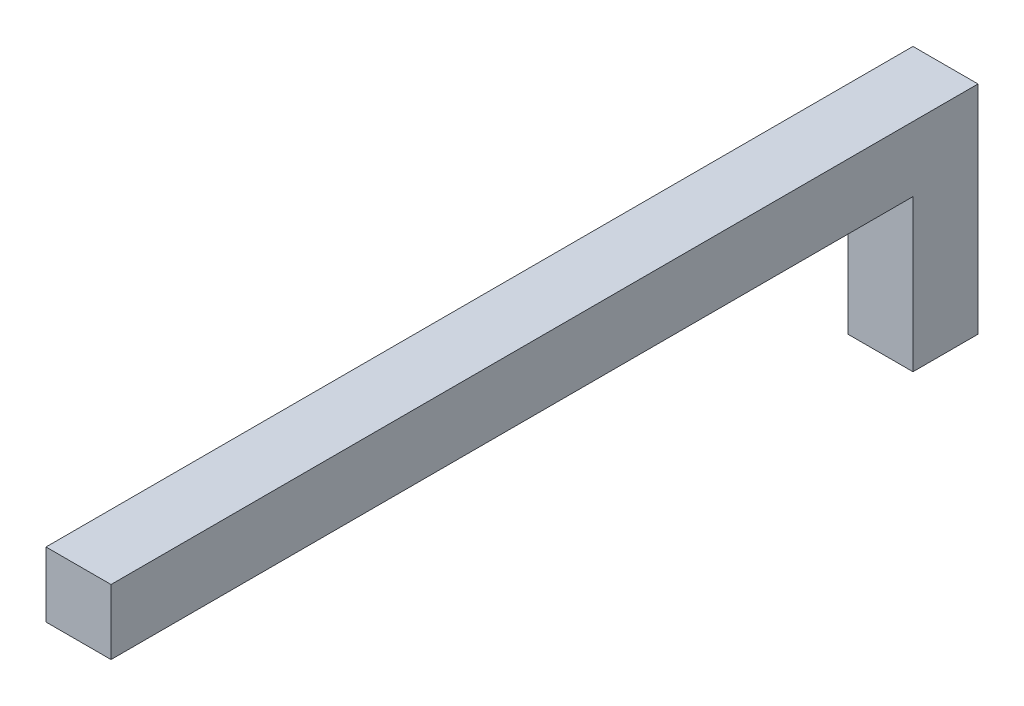
ISO-10303-21;
HEADER;
FILE_DESCRIPTION(('STEP AP214'),'2;1');
FILE_NAME('part.step','',(''),(''),'','','');
FILE_SCHEMA(('AUTOMOTIVE_DESIGN { 1 0 10303 214 1 1 1 1 }'));
ENDSEC;
DATA;
#1=APPLICATION_CONTEXT('core data for automotive mechanical design processes');
#2=APPLICATION_PROTOCOL_DEFINITION('international standard','automotive_design',2000,#1);
#3=PRODUCT_CONTEXT('',#1,'mechanical');
#4=PRODUCT('Part','Part','',(#3));
#5=PRODUCT_RELATED_PRODUCT_CATEGORY('part','',(#4));
#6=PRODUCT_DEFINITION_FORMATION('','',#4);
#7=PRODUCT_DEFINITION_CONTEXT('part definition',#1,'design');
#8=PRODUCT_DEFINITION('design','',#6,#7);
#9=PRODUCT_DEFINITION_SHAPE('','',#8);
#10=(LENGTH_UNIT() NAMED_UNIT(*) SI_UNIT(.MILLI.,.METRE.));
#11=(NAMED_UNIT(*) PLANE_ANGLE_UNIT() SI_UNIT($,.RADIAN.));
#12=(NAMED_UNIT(*) SI_UNIT($,.STERADIAN.) SOLID_ANGLE_UNIT());
#13=UNCERTAINTY_MEASURE_WITH_UNIT(LENGTH_MEASURE(1.E-05),#10,'distance_accuracy_value','');
#14=(GEOMETRIC_REPRESENTATION_CONTEXT(3) GLOBAL_UNCERTAINTY_ASSIGNED_CONTEXT((#13)) GLOBAL_UNIT_ASSIGNED_CONTEXT((#10,
#11,#12)) REPRESENTATION_CONTEXT('',''));
#15=CARTESIAN_POINT('',(0.,0.,0.));
#16=DIRECTION('',(0.,0.,1.));
#17=DIRECTION('',(1.,0.,0.));
#18=AXIS2_PLACEMENT_3D('',#15,#16,#17);
#19=CARTESIAN_POINT('',(0.3,2.,-0.3));
#20=DIRECTION('',(0.,-1.,0.));
#21=DIRECTION('',(0.,0.,-1.));
#22=AXIS2_PLACEMENT_3D('',#19,#20,#21);
#23=PLANE('',#22);
#24=DIRECTION('',(0.,0.,1.));
#25=VECTOR('',#24,1.);
#26=CARTESIAN_POINT('',(-0.3,2.,-0.3));
#27=LINE('',#26,#25);
#28=CARTESIAN_POINT('',(-0.3,2.,-0.3));
#29=VERTEX_POINT('',#28);
#30=CARTESIAN_POINT('',(-0.3,2.,7.7));
#31=VERTEX_POINT('',#30);
#32=EDGE_CURVE('E116',#29,#31,#27,.T.);
#33=ORIENTED_EDGE('',*,*,#32,.T.);
#34=DIRECTION('',(-1.,0.,0.));
#35=VECTOR('',#34,1.);
#36=CARTESIAN_POINT('',(0.3,2.,7.7));
#37=LINE('',#36,#35);
#38=CARTESIAN_POINT('',(0.3,2.,7.7));
#39=VERTEX_POINT('',#38);
#40=EDGE_CURVE('E11',#39,#31,#37,.T.);
#41=ORIENTED_EDGE('',*,*,#40,.F.);
#42=DIRECTION('',(0.,0.,1.));
#43=VECTOR('',#42,1.);
#44=CARTESIAN_POINT('',(0.3,2.,-0.3));
#45=LINE('',#44,#43);
#46=CARTESIAN_POINT('',(0.3,2.,-0.3));
#47=VERTEX_POINT('',#46);
#48=EDGE_CURVE('E126',#47,#39,#45,.T.);
#49=ORIENTED_EDGE('',*,*,#48,.F.);
#50=DIRECTION('',(-1.,0.,0.));
#51=VECTOR('',#50,1.);
#52=CARTESIAN_POINT('',(0.3,2.,-0.3));
#53=LINE('',#52,#51);
#54=EDGE_CURVE('E112',#47,#29,#53,.T.);
#55=ORIENTED_EDGE('',*,*,#54,.T.);
#56=EDGE_LOOP('',(#33,#41,#49,#55));
#57=FACE_BOUND('',#56,.T.);
#58=ADVANCED_FACE('F32',(#57),#23,.F.);
#59=CARTESIAN_POINT('',(0.3,2.,7.7));
#60=DIRECTION('',(0.,0.,-1.));
#61=DIRECTION('',(-1.,0.,0.));
#62=AXIS2_PLACEMENT_3D('',#59,#60,#61);
#63=PLANE('',#62);
#64=DIRECTION('',(0.,-1.,0.));
#65=VECTOR('',#64,1.);
#66=CARTESIAN_POINT('',(-0.3,2.,7.7));
#67=LINE('',#66,#65);
#68=CARTESIAN_POINT('',(-0.3,1.4,7.7));
#69=VERTEX_POINT('',#68);
#70=EDGE_CURVE('E119',#31,#69,#67,.T.);
#71=ORIENTED_EDGE('',*,*,#70,.T.);
#72=DIRECTION('',(-1.,0.,0.));
#73=VECTOR('',#72,1.);
#74=CARTESIAN_POINT('',(0.3,1.4,7.7));
#75=LINE('',#74,#73);
#76=CARTESIAN_POINT('',(0.3,1.4,7.7));
#77=VERTEX_POINT('',#76);
#78=EDGE_CURVE('E40',#77,#69,#75,.T.);
#79=ORIENTED_EDGE('',*,*,#78,.F.);
#80=DIRECTION('',(0.,-1.,0.));
#81=VECTOR('',#80,1.);
#82=CARTESIAN_POINT('',(0.3,2.,7.7));
#83=LINE('',#82,#81);
#84=EDGE_CURVE('E85',#39,#77,#83,.T.);
#85=ORIENTED_EDGE('',*,*,#84,.F.);
#86=ORIENTED_EDGE('',*,*,#40,.T.);
#87=EDGE_LOOP('',(#71,#79,#85,#86));
#88=FACE_BOUND('',#87,.T.);
#89=ADVANCED_FACE('F150',(#88),#63,.F.);
#90=CARTESIAN_POINT('',(0.3,1.4,7.7));
#91=DIRECTION('',(0.,1.,0.));
#92=DIRECTION('',(0.,0.,1.));
#93=AXIS2_PLACEMENT_3D('',#90,#91,#92);
#94=PLANE('',#93);
#95=DIRECTION('',(0.,0.,-1.));
#96=VECTOR('',#95,1.);
#97=CARTESIAN_POINT('',(-0.3,1.4,7.7));
#98=LINE('',#97,#96);
#99=CARTESIAN_POINT('',(-0.3,1.4,0.3));
#100=VERTEX_POINT('',#99);
#101=EDGE_CURVE('E121',#69,#100,#98,.T.);
#102=ORIENTED_EDGE('',*,*,#101,.T.);
#103=DIRECTION('',(-1.,0.,0.));
#104=VECTOR('',#103,1.);
#105=CARTESIAN_POINT('',(0.3,1.4,0.3));
#106=LINE('',#105,#104);
#107=CARTESIAN_POINT('',(0.3,1.4,0.3));
#108=VERTEX_POINT('',#107);
#109=EDGE_CURVE('E107',#108,#100,#106,.T.);
#110=ORIENTED_EDGE('',*,*,#109,.F.);
#111=DIRECTION('',(0.,0.,-1.));
#112=VECTOR('',#111,1.);
#113=CARTESIAN_POINT('',(0.3,1.4,7.7));
#114=LINE('',#113,#112);
#115=EDGE_CURVE('E98',#77,#108,#114,.T.);
#116=ORIENTED_EDGE('',*,*,#115,.F.);
#117=ORIENTED_EDGE('',*,*,#78,.T.);
#118=EDGE_LOOP('',(#102,#110,#116,#117));
#119=FACE_BOUND('',#118,.T.);
#120=ADVANCED_FACE('F132',(#119),#94,.F.);
#121=CARTESIAN_POINT('',(0.3,1.4,0.3));
#122=DIRECTION('',(0.,0.,-1.));
#123=DIRECTION('',(0.,1.,0.));
#124=AXIS2_PLACEMENT_3D('',#121,#122,#123);
#125=PLANE('',#124);
#126=DIRECTION('',(0.,-1.,0.));
#127=VECTOR('',#126,1.);
#128=CARTESIAN_POINT('',(-0.3,1.4,0.3));
#129=LINE('',#128,#127);
#130=CARTESIAN_POINT('',(-0.3,0.,0.3));
#131=VERTEX_POINT('',#130);
#132=EDGE_CURVE('E106',#100,#131,#129,.T.);
#133=ORIENTED_EDGE('',*,*,#132,.T.);
#134=DIRECTION('',(-1.,0.,0.));
#135=VECTOR('',#134,1.);
#136=CARTESIAN_POINT('',(0.3,0.,0.3));
#137=LINE('',#136,#135);
#138=CARTESIAN_POINT('',(0.3,0.,0.3));
#139=VERTEX_POINT('',#138);
#140=EDGE_CURVE('E103',#139,#131,#137,.T.);
#141=ORIENTED_EDGE('',*,*,#140,.F.);
#142=DIRECTION('',(0.,-1.,0.));
#143=VECTOR('',#142,1.);
#144=CARTESIAN_POINT('',(0.3,1.4,0.3));
#145=LINE('',#144,#143);
#146=EDGE_CURVE('E92',#108,#139,#145,.T.);
#147=ORIENTED_EDGE('',*,*,#146,.F.);
#148=ORIENTED_EDGE('',*,*,#109,.T.);
#149=EDGE_LOOP('',(#133,#141,#147,#148));
#150=FACE_BOUND('',#149,.T.);
#151=ADVANCED_FACE('F104',(#150),#125,.F.);
#152=CARTESIAN_POINT('',(0.3,0.,0.3));
#153=DIRECTION('',(0.,1.,0.));
#154=DIRECTION('',(0.,0.,1.));
#155=AXIS2_PLACEMENT_3D('',#152,#153,#154);
#156=PLANE('',#155);
#157=DIRECTION('',(0.,0.,-1.));
#158=VECTOR('',#157,1.);
#159=CARTESIAN_POINT('',(-0.3,0.,0.3));
#160=LINE('',#159,#158);
#161=CARTESIAN_POINT('',(-0.3,0.,-0.3));
#162=VERTEX_POINT('',#161);
#163=EDGE_CURVE('E71',#131,#162,#160,.T.);
#164=ORIENTED_EDGE('',*,*,#163,.T.);
#165=DIRECTION('',(-1.,0.,0.));
#166=VECTOR('',#165,1.);
#167=CARTESIAN_POINT('',(0.3,0.,-0.3));
#168=LINE('',#167,#166);
#169=CARTESIAN_POINT('',(0.3,0.,-0.3));
#170=VERTEX_POINT('',#169);
#171=EDGE_CURVE('E108',#170,#162,#168,.T.);
#172=ORIENTED_EDGE('',*,*,#171,.F.);
#173=DIRECTION('',(0.,0.,-1.));
#174=VECTOR('',#173,1.);
#175=CARTESIAN_POINT('',(0.3,0.,0.3));
#176=LINE('',#175,#174);
#177=EDGE_CURVE('E96',#139,#170,#176,.T.);
#178=ORIENTED_EDGE('',*,*,#177,.F.);
#179=ORIENTED_EDGE('',*,*,#140,.T.);
#180=EDGE_LOOP('',(#164,#172,#178,#179));
#181=FACE_BOUND('',#180,.T.);
#182=ADVANCED_FACE('F110',(#181),#156,.F.);
#183=CARTESIAN_POINT('',(0.3,0.,-0.3));
#184=DIRECTION('',(0.,0.,1.));
#185=DIRECTION('',(0.,-1.,0.));
#186=AXIS2_PLACEMENT_3D('',#183,#184,#185);
#187=PLANE('',#186);
#188=DIRECTION('',(0.,1.,0.));
#189=VECTOR('',#188,1.);
#190=CARTESIAN_POINT('',(-0.3,0.,-0.3));
#191=LINE('',#190,#189);
#192=EDGE_CURVE('E77',#162,#29,#191,.T.);
#193=ORIENTED_EDGE('',*,*,#192,.T.);
#194=ORIENTED_EDGE('',*,*,#54,.F.);
#195=DIRECTION('',(0.,1.,0.));
#196=VECTOR('',#195,1.);
#197=CARTESIAN_POINT('',(0.3,0.,-0.3));
#198=LINE('',#197,#196);
#199=EDGE_CURVE('E48',#170,#47,#198,.T.);
#200=ORIENTED_EDGE('',*,*,#199,.F.);
#201=ORIENTED_EDGE('',*,*,#171,.T.);
#202=EDGE_LOOP('',(#193,#194,#200,#201));
#203=FACE_BOUND('',#202,.T.);
#204=ADVANCED_FACE('F139',(#203),#187,.F.);
#205=CARTESIAN_POINT('',(0.3,0.,0.));
#206=DIRECTION('',(1.,0.,0.));
#207=DIRECTION('',(0.,0.,-1.));
#208=AXIS2_PLACEMENT_3D('',#205,#206,#207);
#209=PLANE('',#208);
#210=ORIENTED_EDGE('',*,*,#48,.T.);
#211=ORIENTED_EDGE('',*,*,#84,.T.);
#212=ORIENTED_EDGE('',*,*,#115,.T.);
#213=ORIENTED_EDGE('',*,*,#146,.T.);
#214=ORIENTED_EDGE('',*,*,#177,.T.);
#215=ORIENTED_EDGE('',*,*,#199,.T.);
#216=EDGE_LOOP('',(#210,#211,#212,#213,#214,#215));
#217=FACE_BOUND('',#216,.T.);
#218=ADVANCED_FACE('F94',(#217),#209,.T.);
#219=CARTESIAN_POINT('',(-0.3,0.,0.));
#220=DIRECTION('',(1.,0.,0.));
#221=DIRECTION('',(0.,0.,-1.));
#222=AXIS2_PLACEMENT_3D('',#219,#220,#221);
#223=PLANE('',#222);
#224=ORIENTED_EDGE('',*,*,#32,.F.);
#225=ORIENTED_EDGE('',*,*,#192,.F.);
#226=ORIENTED_EDGE('',*,*,#163,.F.);
#227=ORIENTED_EDGE('',*,*,#132,.F.);
#228=ORIENTED_EDGE('',*,*,#101,.F.);
#229=ORIENTED_EDGE('',*,*,#70,.F.);
#230=EDGE_LOOP('',(#224,#225,#226,#227,#228,#229));
#231=FACE_BOUND('',#230,.T.);
#232=ADVANCED_FACE('F135',(#231),#223,.F.);
#233=CLOSED_SHELL('',(#58,#89,#120,#151,#182,#204,#218,#232));
#234=MANIFOLD_SOLID_BREP('B2',#233);
#235=ADVANCED_BREP_SHAPE_REPRESENTATION('',(#18,#234),#14);
#236=SHAPE_DEFINITION_REPRESENTATION(#9,#235);
ENDSEC;
END-ISO-10303-21;
